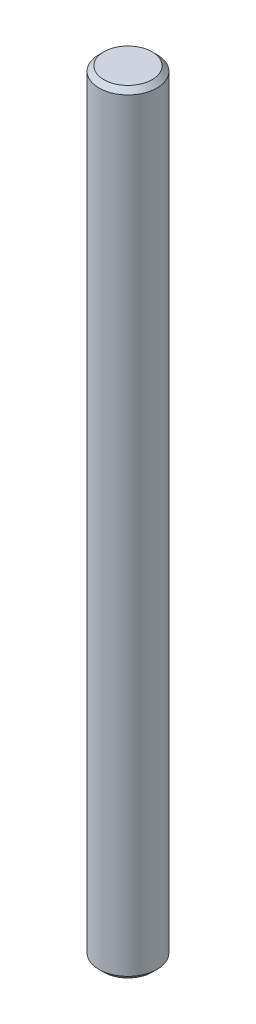
ISO-10303-21;
HEADER;
FILE_DESCRIPTION(('STEP AP214'),'2;1');
FILE_NAME('part.step','',(''),(''),'','','');
FILE_SCHEMA(('AUTOMOTIVE_DESIGN { 1 0 10303 214 1 1 1 1 }'));
ENDSEC;
DATA;
#1=APPLICATION_CONTEXT('core data for automotive mechanical design processes');
#2=APPLICATION_PROTOCOL_DEFINITION('international standard','automotive_design',2000,#1);
#3=PRODUCT_CONTEXT('',#1,'mechanical');
#4=PRODUCT('Part','Part','',(#3));
#5=PRODUCT_RELATED_PRODUCT_CATEGORY('part','',(#4));
#6=PRODUCT_DEFINITION_FORMATION('','',#4);
#7=PRODUCT_DEFINITION_CONTEXT('part definition',#1,'design');
#8=PRODUCT_DEFINITION('design','',#6,#7);
#9=PRODUCT_DEFINITION_SHAPE('','',#8);
#10=(LENGTH_UNIT() NAMED_UNIT(*) SI_UNIT(.MILLI.,.METRE.));
#11=(NAMED_UNIT(*) PLANE_ANGLE_UNIT() SI_UNIT($,.RADIAN.));
#12=(NAMED_UNIT(*) SI_UNIT($,.STERADIAN.) SOLID_ANGLE_UNIT());
#13=UNCERTAINTY_MEASURE_WITH_UNIT(LENGTH_MEASURE(1.E-05),#10,'distance_accuracy_value','');
#14=(GEOMETRIC_REPRESENTATION_CONTEXT(3) GLOBAL_UNCERTAINTY_ASSIGNED_CONTEXT((#13)) GLOBAL_UNIT_ASSIGNED_CONTEXT((#10,
#11,#12)) REPRESENTATION_CONTEXT('',''));
#15=CARTESIAN_POINT('',(0.,0.,0.));
#16=DIRECTION('',(0.,0.,1.));
#17=DIRECTION('',(1.,0.,0.));
#18=AXIS2_PLACEMENT_3D('',#15,#16,#17);
#19=CARTESIAN_POINT('',(0.,80.,0.));
#20=DIRECTION('',(0.,-1.,0.));
#21=DIRECTION('',(0.,0.,-1.));
#22=AXIS2_PLACEMENT_3D('',#19,#20,#21);
#23=CYLINDRICAL_SURFACE('',#22,3.);
#24=CARTESIAN_POINT('',(0.,0.499999999999987,0.));
#25=DIRECTION('',(0.,1.,0.));
#26=DIRECTION('',(0.,0.,1.));
#27=AXIS2_PLACEMENT_3D('',#24,#25,#26);
#28=CIRCLE('',#27,3.);
#29=CARTESIAN_POINT('',(0.,0.499999999999987,3.));
#30=VERTEX_POINT('',#29);
#31=EDGE_CURVE('E62',#30,#30,#28,.T.);
#32=ORIENTED_EDGE('',*,*,#31,.T.);
#33=EDGE_LOOP('',(#32));
#34=FACE_BOUND('',#33,.T.);
#35=CARTESIAN_POINT('',(0.,79.5,0.));
#36=DIRECTION('',(0.,1.,0.));
#37=DIRECTION('',(0.,0.,1.));
#38=AXIS2_PLACEMENT_3D('',#35,#36,#37);
#39=CIRCLE('',#38,3.);
#40=CARTESIAN_POINT('',(0.,79.5,3.));
#41=VERTEX_POINT('',#40);
#42=EDGE_CURVE('E67',#41,#41,#39,.F.);
#43=ORIENTED_EDGE('',*,*,#42,.T.);
#44=EDGE_LOOP('',(#43));
#45=FACE_BOUND('',#44,.T.);
#46=ADVANCED_FACE('F48',(#34,#45),#23,.T.);
#47=CARTESIAN_POINT('',(0.,80.,0.));
#48=DIRECTION('',(0.,1.,0.));
#49=DIRECTION('',(0.,0.,1.));
#50=AXIS2_PLACEMENT_3D('',#47,#48,#49);
#51=PLANE('',#50);
#52=CARTESIAN_POINT('',(0.,80.,0.));
#53=DIRECTION('',(0.,1.,0.));
#54=DIRECTION('',(0.,0.,1.));
#55=AXIS2_PLACEMENT_3D('',#52,#53,#54);
#56=CIRCLE('',#55,2.5);
#57=CARTESIAN_POINT('',(0.,80.,2.5));
#58=VERTEX_POINT('',#57);
#59=EDGE_CURVE('E12',#58,#58,#56,.T.);
#60=ORIENTED_EDGE('',*,*,#59,.T.);
#61=EDGE_LOOP('',(#60));
#62=FACE_BOUND('',#61,.T.);
#63=ADVANCED_FACE('F83',(#62),#51,.T.);
#64=CARTESIAN_POINT('',(0.,0.,0.));
#65=DIRECTION('',(0.,1.,0.));
#66=DIRECTION('',(0.,0.,1.));
#67=AXIS2_PLACEMENT_3D('',#64,#65,#66);
#68=PLANE('',#67);
#69=CARTESIAN_POINT('',(0.,0.,0.));
#70=DIRECTION('',(0.,1.,0.));
#71=DIRECTION('',(0.,0.,1.));
#72=AXIS2_PLACEMENT_3D('',#69,#70,#71);
#73=CIRCLE('',#72,2.50000000000002);
#74=CARTESIAN_POINT('',(0.,0.,2.50000000000002));
#75=VERTEX_POINT('',#74);
#76=EDGE_CURVE('E56',#75,#75,#73,.F.);
#77=ORIENTED_EDGE('',*,*,#76,.T.);
#78=EDGE_LOOP('',(#77));
#79=FACE_BOUND('',#78,.T.);
#80=ADVANCED_FACE('F80',(#79),#68,.F.);
#81=CARTESIAN_POINT('',(0.,0.499999999999987,0.));
#82=DIRECTION('',(0.,1.,0.));
#83=DIRECTION('',(0.,0.,1.));
#84=AXIS2_PLACEMENT_3D('',#81,#82,#83);
#85=CONICAL_SURFACE('',#84,3.,0.785398163397445);
#86=ORIENTED_EDGE('',*,*,#76,.F.);
#87=EDGE_LOOP('',(#86));
#88=FACE_BOUND('',#87,.T.);
#89=ORIENTED_EDGE('',*,*,#31,.F.);
#90=EDGE_LOOP('',(#89));
#91=FACE_BOUND('',#90,.T.);
#92=ADVANCED_FACE('F76',(#88,#91),#85,.T.);
#93=CARTESIAN_POINT('',(0.,80.,0.));
#94=DIRECTION('',(0.,-1.,0.));
#95=DIRECTION('',(0.,0.,-1.));
#96=AXIS2_PLACEMENT_3D('',#93,#94,#95);
#97=CONICAL_SURFACE('',#96,2.5,0.785398163397452);
#98=ORIENTED_EDGE('',*,*,#42,.F.);
#99=EDGE_LOOP('',(#98));
#100=FACE_BOUND('',#99,.T.);
#101=ORIENTED_EDGE('',*,*,#59,.F.);
#102=EDGE_LOOP('',(#101));
#103=FACE_BOUND('',#102,.T.);
#104=ADVANCED_FACE('F50',(#100,#103),#97,.T.);
#105=CLOSED_SHELL('',(#46,#63,#80,#92,#104));
#106=MANIFOLD_SOLID_BREP('B2',#105);
#107=ADVANCED_BREP_SHAPE_REPRESENTATION('',(#18,#106),#14);
#108=SHAPE_DEFINITION_REPRESENTATION(#9,#107);
ENDSEC;
END-ISO-10303-21;
